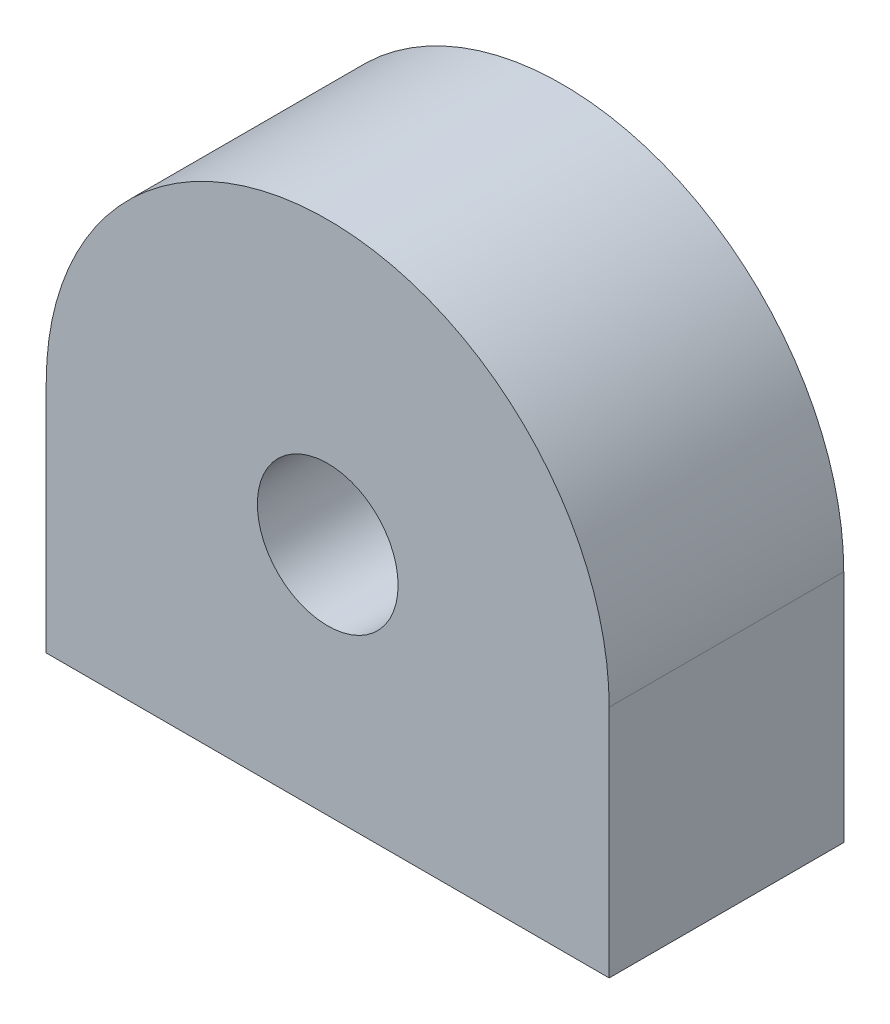
ISO-10303-21;
HEADER;
FILE_DESCRIPTION(('STEP AP214'),'2;1');
FILE_NAME('part.step','',(''),(''),'','','');
FILE_SCHEMA(('AUTOMOTIVE_DESIGN { 1 0 10303 214 1 1 1 1 }'));
ENDSEC;
DATA;
#1=APPLICATION_CONTEXT('core data for automotive mechanical design processes');
#2=APPLICATION_PROTOCOL_DEFINITION('international standard','automotive_design',2000,#1);
#3=PRODUCT_CONTEXT('',#1,'mechanical');
#4=PRODUCT('Part','Part','',(#3));
#5=PRODUCT_RELATED_PRODUCT_CATEGORY('part','',(#4));
#6=PRODUCT_DEFINITION_FORMATION('','',#4);
#7=PRODUCT_DEFINITION_CONTEXT('part definition',#1,'design');
#8=PRODUCT_DEFINITION('design','',#6,#7);
#9=PRODUCT_DEFINITION_SHAPE('','',#8);
#10=(LENGTH_UNIT() NAMED_UNIT(*) SI_UNIT(.MILLI.,.METRE.));
#11=(NAMED_UNIT(*) PLANE_ANGLE_UNIT() SI_UNIT($,.RADIAN.));
#12=(NAMED_UNIT(*) SI_UNIT($,.STERADIAN.) SOLID_ANGLE_UNIT());
#13=UNCERTAINTY_MEASURE_WITH_UNIT(LENGTH_MEASURE(1.E-05),#10,'distance_accuracy_value','');
#14=(GEOMETRIC_REPRESENTATION_CONTEXT(3) GLOBAL_UNCERTAINTY_ASSIGNED_CONTEXT((#13)) GLOBAL_UNIT_ASSIGNED_CONTEXT((#10,
#11,#12)) REPRESENTATION_CONTEXT('',''));
#15=CARTESIAN_POINT('',(0.,0.,0.));
#16=DIRECTION('',(0.,0.,1.));
#17=DIRECTION('',(1.,0.,0.));
#18=AXIS2_PLACEMENT_3D('',#15,#16,#17);
#19=CARTESIAN_POINT('',(-6.00000000000001,0.,2.5));
#20=DIRECTION('',(1.,0.,0.));
#21=DIRECTION('',(0.,0.,-1.));
#22=AXIS2_PLACEMENT_3D('',#19,#20,#21);
#23=PLANE('',#22);
#24=DIRECTION('',(0.,-1.,0.));
#25=VECTOR('',#24,1.);
#26=CARTESIAN_POINT('',(-6.00000000000001,0.,-2.5));
#27=LINE('',#26,#25);
#28=CARTESIAN_POINT('',(-6.00000000000001,0.,-2.5));
#29=VERTEX_POINT('',#28);
#30=CARTESIAN_POINT('',(-6.00000000000001,-5.,-2.5));
#31=VERTEX_POINT('',#30);
#32=EDGE_CURVE('E96',#29,#31,#27,.T.);
#33=ORIENTED_EDGE('',*,*,#32,.T.);
#34=DIRECTION('',(0.,0.,-1.));
#35=VECTOR('',#34,1.);
#36=CARTESIAN_POINT('',(-6.00000000000001,-5.,2.5));
#37=LINE('',#36,#35);
#38=CARTESIAN_POINT('',(-6.00000000000001,-5.,2.5));
#39=VERTEX_POINT('',#38);
#40=EDGE_CURVE('E11',#39,#31,#37,.T.);
#41=ORIENTED_EDGE('',*,*,#40,.F.);
#42=DIRECTION('',(0.,-1.,0.));
#43=VECTOR('',#42,1.);
#44=CARTESIAN_POINT('',(-6.00000000000001,0.,2.5));
#45=LINE('',#44,#43);
#46=CARTESIAN_POINT('',(-6.00000000000001,0.,2.5));
#47=VERTEX_POINT('',#46);
#48=EDGE_CURVE('E82',#47,#39,#45,.T.);
#49=ORIENTED_EDGE('',*,*,#48,.F.);
#50=DIRECTION('',(0.,0.,-1.));
#51=VECTOR('',#50,1.);
#52=CARTESIAN_POINT('',(-6.00000000000001,0.,2.5));
#53=LINE('',#52,#51);
#54=EDGE_CURVE('E49',#47,#29,#53,.T.);
#55=ORIENTED_EDGE('',*,*,#54,.T.);
#56=EDGE_LOOP('',(#33,#41,#49,#55));
#57=FACE_BOUND('',#56,.T.);
#58=ADVANCED_FACE('F33',(#57),#23,.F.);
#59=CARTESIAN_POINT('',(-6.00000000000001,-5.,2.5));
#60=DIRECTION('',(0.,1.,0.));
#61=DIRECTION('',(0.,0.,1.));
#62=AXIS2_PLACEMENT_3D('',#59,#60,#61);
#63=PLANE('',#62);
#64=DIRECTION('',(1.,0.,0.));
#65=VECTOR('',#64,1.);
#66=CARTESIAN_POINT('',(-6.00000000000001,-5.,-2.5));
#67=LINE('',#66,#65);
#68=CARTESIAN_POINT('',(6.00000000000001,-5.,-2.5));
#69=VERTEX_POINT('',#68);
#70=EDGE_CURVE('E87',#31,#69,#67,.T.);
#71=ORIENTED_EDGE('',*,*,#70,.T.);
#72=DIRECTION('',(0.,0.,-1.));
#73=VECTOR('',#72,1.);
#74=CARTESIAN_POINT('',(6.00000000000001,-5.,2.5));
#75=LINE('',#74,#73);
#76=CARTESIAN_POINT('',(6.00000000000001,-5.,2.5));
#77=VERTEX_POINT('',#76);
#78=EDGE_CURVE('E41',#77,#69,#75,.T.);
#79=ORIENTED_EDGE('',*,*,#78,.F.);
#80=DIRECTION('',(1.,0.,0.));
#81=VECTOR('',#80,1.);
#82=CARTESIAN_POINT('',(-6.00000000000001,-5.,2.5));
#83=LINE('',#82,#81);
#84=EDGE_CURVE('E74',#39,#77,#83,.T.);
#85=ORIENTED_EDGE('',*,*,#84,.F.);
#86=ORIENTED_EDGE('',*,*,#40,.T.);
#87=EDGE_LOOP('',(#71,#79,#85,#86));
#88=FACE_BOUND('',#87,.T.);
#89=ADVANCED_FACE('F86',(#88),#63,.F.);
#90=CARTESIAN_POINT('',(6.00000000000001,0.,2.5));
#91=DIRECTION('',(1.,0.,0.));
#92=DIRECTION('',(0.,0.,-1.));
#93=AXIS2_PLACEMENT_3D('',#90,#91,#92);
#94=PLANE('',#93);
#95=DIRECTION('',(0.,-1.,0.));
#96=VECTOR('',#95,1.);
#97=CARTESIAN_POINT('',(6.00000000000001,0.,-2.5));
#98=LINE('',#97,#96);
#99=CARTESIAN_POINT('',(6.00000000000001,0.,-2.5));
#100=VERTEX_POINT('',#99);
#101=EDGE_CURVE('E100',#100,#69,#98,.T.);
#102=ORIENTED_EDGE('',*,*,#101,.F.);
#103=DIRECTION('',(0.,0.,-1.));
#104=VECTOR('',#103,1.);
#105=CARTESIAN_POINT('',(6.00000000000001,0.,2.5));
#106=LINE('',#105,#104);
#107=CARTESIAN_POINT('',(6.00000000000001,0.,2.5));
#108=VERTEX_POINT('',#107);
#109=EDGE_CURVE('E63',#108,#100,#106,.T.);
#110=ORIENTED_EDGE('',*,*,#109,.F.);
#111=DIRECTION('',(0.,-1.,0.));
#112=VECTOR('',#111,1.);
#113=CARTESIAN_POINT('',(6.00000000000001,0.,2.5));
#114=LINE('',#113,#112);
#115=EDGE_CURVE('E81',#108,#77,#114,.T.);
#116=ORIENTED_EDGE('',*,*,#115,.T.);
#117=ORIENTED_EDGE('',*,*,#78,.T.);
#118=EDGE_LOOP('',(#102,#110,#116,#117));
#119=FACE_BOUND('',#118,.T.);
#120=ADVANCED_FACE('F90',(#119),#94,.T.);
#121=CARTESIAN_POINT('',(0.,0.,2.5));
#122=DIRECTION('',(0.,0.,-1.));
#123=DIRECTION('',(-1.,0.,0.));
#124=AXIS2_PLACEMENT_3D('',#121,#122,#123);
#125=CYLINDRICAL_SURFACE('',#124,6.00000000000001);
#126=CARTESIAN_POINT('',(0.,0.,-2.5));
#127=DIRECTION('',(0.,0.,-1.));
#128=DIRECTION('',(-1.,0.,0.));
#129=AXIS2_PLACEMENT_3D('',#126,#127,#128);
#130=CIRCLE('',#129,6.00000000000001);
#131=EDGE_CURVE('E102',#29,#100,#130,.T.);
#132=ORIENTED_EDGE('',*,*,#131,.F.);
#133=ORIENTED_EDGE('',*,*,#54,.F.);
#134=CARTESIAN_POINT('',(0.,0.,2.5));
#135=DIRECTION('',(0.,0.,-1.));
#136=DIRECTION('',(-1.,0.,0.));
#137=AXIS2_PLACEMENT_3D('',#134,#135,#136);
#138=CIRCLE('',#137,6.00000000000001);
#139=EDGE_CURVE('E91',#47,#108,#138,.T.);
#140=ORIENTED_EDGE('',*,*,#139,.T.);
#141=ORIENTED_EDGE('',*,*,#109,.T.);
#142=EDGE_LOOP('',(#132,#133,#140,#141));
#143=FACE_BOUND('',#142,.T.);
#144=ADVANCED_FACE('F118',(#143),#125,.T.);
#145=CARTESIAN_POINT('',(0.,0.,2.5));
#146=DIRECTION('',(0.,0.,-1.));
#147=DIRECTION('',(-1.,0.,0.));
#148=AXIS2_PLACEMENT_3D('',#145,#146,#147);
#149=PLANE('',#148);
#150=CARTESIAN_POINT('',(0.,0.,2.5));
#151=DIRECTION('',(0.,0.,1.));
#152=DIRECTION('',(1.,0.,0.));
#153=AXIS2_PLACEMENT_3D('',#150,#151,#152);
#154=CIRCLE('',#153,1.5);
#155=CARTESIAN_POINT('',(1.5,0.,2.5));
#156=VERTEX_POINT('',#155);
#157=EDGE_CURVE('E110',#156,#156,#154,.T.);
#158=ORIENTED_EDGE('',*,*,#157,.F.);
#159=EDGE_LOOP('',(#158));
#160=FACE_BOUND('',#159,.T.);
#161=ORIENTED_EDGE('',*,*,#48,.T.);
#162=ORIENTED_EDGE('',*,*,#84,.T.);
#163=ORIENTED_EDGE('',*,*,#115,.F.);
#164=ORIENTED_EDGE('',*,*,#139,.F.);
#165=EDGE_LOOP('',(#161,#162,#163,#164));
#166=FACE_BOUND('',#165,.T.);
#167=ADVANCED_FACE('F78',(#160,#166),#149,.F.);
#168=CARTESIAN_POINT('',(0.,0.,-2.5));
#169=DIRECTION('',(0.,0.,-1.));
#170=DIRECTION('',(-1.,0.,0.));
#171=AXIS2_PLACEMENT_3D('',#168,#169,#170);
#172=PLANE('',#171);
#173=CARTESIAN_POINT('',(0.,0.,-2.5));
#174=DIRECTION('',(0.,0.,1.));
#175=DIRECTION('',(1.,0.,0.));
#176=AXIS2_PLACEMENT_3D('',#173,#174,#175);
#177=CIRCLE('',#176,1.5);
#178=CARTESIAN_POINT('',(1.5,0.,-2.5));
#179=VERTEX_POINT('',#178);
#180=EDGE_CURVE('E98',#179,#179,#177,.T.);
#181=ORIENTED_EDGE('',*,*,#180,.T.);
#182=EDGE_LOOP('',(#181));
#183=FACE_BOUND('',#182,.T.);
#184=ORIENTED_EDGE('',*,*,#32,.F.);
#185=ORIENTED_EDGE('',*,*,#131,.T.);
#186=ORIENTED_EDGE('',*,*,#101,.T.);
#187=ORIENTED_EDGE('',*,*,#70,.F.);
#188=EDGE_LOOP('',(#184,#185,#186,#187));
#189=FACE_BOUND('',#188,.T.);
#190=ADVANCED_FACE('F117',(#183,#189),#172,.T.);
#191=CARTESIAN_POINT('',(0.,0.,-2.5));
#192=DIRECTION('',(0.,0.,1.));
#193=DIRECTION('',(1.,0.,0.));
#194=AXIS2_PLACEMENT_3D('',#191,#192,#193);
#195=CYLINDRICAL_SURFACE('',#194,1.5);
#196=ORIENTED_EDGE('',*,*,#180,.F.);
#197=EDGE_LOOP('',(#196));
#198=FACE_BOUND('',#197,.T.);
#199=ORIENTED_EDGE('',*,*,#157,.T.);
#200=EDGE_LOOP('',(#199));
#201=FACE_BOUND('',#200,.T.);
#202=ADVANCED_FACE('F114',(#198,#201),#195,.F.);
#203=CLOSED_SHELL('',(#58,#89,#120,#144,#167,#190,#202));
#204=MANIFOLD_SOLID_BREP('B2',#203);
#205=ADVANCED_BREP_SHAPE_REPRESENTATION('',(#18,#204),#14);
#206=SHAPE_DEFINITION_REPRESENTATION(#9,#205);
ENDSEC;
END-ISO-10303-21;
